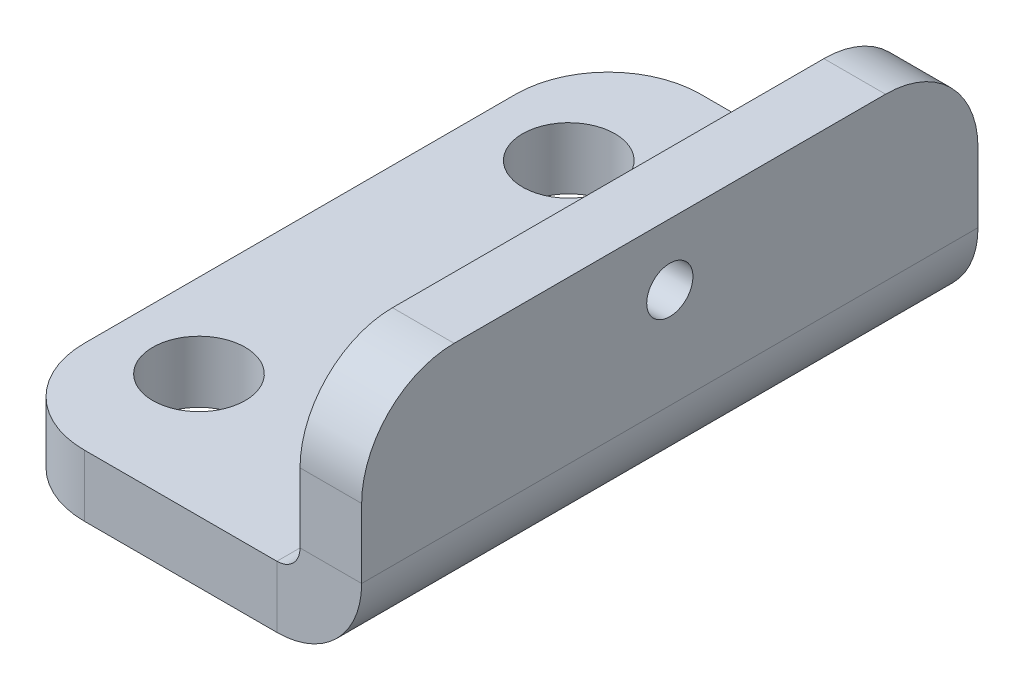
ISO-10303-21;
HEADER;
FILE_DESCRIPTION(('STEP AP214'),'2;1');
FILE_NAME('part.step','',(''),(''),'','','');
FILE_SCHEMA(('AUTOMOTIVE_DESIGN { 1 0 10303 214 1 1 1 1 }'));
ENDSEC;
DATA;
#1=APPLICATION_CONTEXT('core data for automotive mechanical design processes');
#2=APPLICATION_PROTOCOL_DEFINITION('international standard','automotive_design',2000,#1);
#3=PRODUCT_CONTEXT('',#1,'mechanical');
#4=PRODUCT('Part','Part','',(#3));
#5=PRODUCT_RELATED_PRODUCT_CATEGORY('part','',(#4));
#6=PRODUCT_DEFINITION_FORMATION('','',#4);
#7=PRODUCT_DEFINITION_CONTEXT('part definition',#1,'design');
#8=PRODUCT_DEFINITION('design','',#6,#7);
#9=PRODUCT_DEFINITION_SHAPE('','',#8);
#10=(LENGTH_UNIT() NAMED_UNIT(*) SI_UNIT(.MILLI.,.METRE.));
#11=(NAMED_UNIT(*) PLANE_ANGLE_UNIT() SI_UNIT($,.RADIAN.));
#12=(NAMED_UNIT(*) SI_UNIT($,.STERADIAN.) SOLID_ANGLE_UNIT());
#13=UNCERTAINTY_MEASURE_WITH_UNIT(LENGTH_MEASURE(1.E-05),#10,'distance_accuracy_value','');
#14=(GEOMETRIC_REPRESENTATION_CONTEXT(3) GLOBAL_UNCERTAINTY_ASSIGNED_CONTEXT((#13)) GLOBAL_UNIT_ASSIGNED_CONTEXT((#10,
#11,#12)) REPRESENTATION_CONTEXT('',''));
#15=CARTESIAN_POINT('',(0.,0.,0.));
#16=DIRECTION('',(0.,0.,1.));
#17=DIRECTION('',(1.,0.,0.));
#18=AXIS2_PLACEMENT_3D('',#15,#16,#17);
#19=CARTESIAN_POINT('',(-2.75,0.,10.));
#20=DIRECTION('',(0.,0.,1.));
#21=DIRECTION('',(1.,0.,0.));
#22=AXIS2_PLACEMENT_3D('',#19,#20,#21);
#23=PLANE('',#22);
#24=DIRECTION('',(0.,1.,0.));
#25=VECTOR('',#24,1.);
#26=CARTESIAN_POINT('',(-2.75,0.,10.));
#27=LINE('',#26,#25);
#28=CARTESIAN_POINT('',(-2.75,0.,10.));
#29=VERTEX_POINT('',#28);
#30=CARTESIAN_POINT('',(-2.75,2.,10.));
#31=VERTEX_POINT('',#30);
#32=EDGE_CURVE('E127',#29,#31,#27,.T.);
#33=ORIENTED_EDGE('',*,*,#32,.F.);
#34=CARTESIAN_POINT('',(-2.75,2.75,10.));
#35=DIRECTION('',(0.,0.,1.));
#36=DIRECTION('',(1.,0.,0.));
#37=AXIS2_PLACEMENT_3D('',#34,#35,#36);
#38=CIRCLE('',#37,2.75);
#39=CARTESIAN_POINT('',(0.,2.75,10.));
#40=VERTEX_POINT('',#39);
#41=EDGE_CURVE('E131',#40,#29,#38,.F.);
#42=ORIENTED_EDGE('',*,*,#41,.F.);
#43=DIRECTION('',(1.,0.,0.));
#44=VECTOR('',#43,1.);
#45=CARTESIAN_POINT('',(-2.,2.75,10.));
#46=LINE('',#45,#44);
#47=CARTESIAN_POINT('',(-2.,2.75,10.));
#48=VERTEX_POINT('',#47);
#49=EDGE_CURVE('E136',#48,#40,#46,.T.);
#50=ORIENTED_EDGE('',*,*,#49,.F.);
#51=CARTESIAN_POINT('',(-2.75,2.75,10.));
#52=DIRECTION('',(0.,0.,1.));
#53=DIRECTION('',(1.,0.,0.));
#54=AXIS2_PLACEMENT_3D('',#51,#52,#53);
#55=CIRCLE('',#54,0.75);
#56=EDGE_CURVE('E133',#48,#31,#55,.F.);
#57=ORIENTED_EDGE('',*,*,#56,.T.);
#58=EDGE_LOOP('',(#33,#42,#50,#57));
#59=FACE_BOUND('',#58,.T.);
#60=ADVANCED_FACE('F36',(#59),#23,.T.);
#61=CARTESIAN_POINT('',(-2.,2.75,10.));
#62=DIRECTION('',(0.,0.,1.));
#63=DIRECTION('',(1.,0.,0.));
#64=AXIS2_PLACEMENT_3D('',#61,#62,#63);
#65=PLANE('',#64);
#66=DIRECTION('',(-1.,0.,0.));
#67=VECTOR('',#66,1.);
#68=CARTESIAN_POINT('',(0.,2.,10.));
#69=LINE('',#68,#67);
#70=CARTESIAN_POINT('',(-9.,2.,10.));
#71=VERTEX_POINT('',#70);
#72=EDGE_CURVE('E154',#31,#71,#69,.T.);
#73=ORIENTED_EDGE('',*,*,#72,.T.);
#74=DIRECTION('',(0.,1.,0.));
#75=VECTOR('',#74,1.);
#76=CARTESIAN_POINT('',(-9.,2.75,10.));
#77=LINE('',#76,#75);
#78=CARTESIAN_POINT('',(-9.,0.,10.));
#79=VERTEX_POINT('',#78);
#80=EDGE_CURVE('E44',#71,#79,#77,.F.);
#81=ORIENTED_EDGE('',*,*,#80,.T.);
#82=DIRECTION('',(-1.,0.,0.));
#83=VECTOR('',#82,1.);
#84=CARTESIAN_POINT('',(0.,0.,10.));
#85=LINE('',#84,#83);
#86=EDGE_CURVE('E143',#29,#79,#85,.T.);
#87=ORIENTED_EDGE('',*,*,#86,.F.);
#88=ORIENTED_EDGE('',*,*,#32,.T.);
#89=EDGE_LOOP('',(#73,#81,#87,#88));
#90=FACE_BOUND('',#89,.T.);
#91=ADVANCED_FACE('F153',(#90),#65,.T.);
#92=CARTESIAN_POINT('',(0.,2.75,-10.));
#93=DIRECTION('',(0.,0.,-1.));
#94=DIRECTION('',(-1.,0.,0.));
#95=AXIS2_PLACEMENT_3D('',#92,#93,#94);
#96=PLANE('',#95);
#97=DIRECTION('',(-1.,0.,0.));
#98=VECTOR('',#97,1.);
#99=CARTESIAN_POINT('',(0.,2.75,-10.));
#100=LINE('',#99,#98);
#101=CARTESIAN_POINT('',(0.,2.75,-10.));
#102=VERTEX_POINT('',#101);
#103=CARTESIAN_POINT('',(-2.,2.75,-10.));
#104=VERTEX_POINT('',#103);
#105=EDGE_CURVE('E199',#102,#104,#100,.T.);
#106=ORIENTED_EDGE('',*,*,#105,.F.);
#107=CARTESIAN_POINT('',(-2.75,2.75,-10.));
#108=DIRECTION('',(0.,0.,1.));
#109=DIRECTION('',(1.,0.,0.));
#110=AXIS2_PLACEMENT_3D('',#107,#108,#109);
#111=CIRCLE('',#110,2.75);
#112=CARTESIAN_POINT('',(-2.75,0.,-10.));
#113=VERTEX_POINT('',#112);
#114=EDGE_CURVE('E173',#102,#113,#111,.F.);
#115=ORIENTED_EDGE('',*,*,#114,.T.);
#116=DIRECTION('',(0.,-1.,0.));
#117=VECTOR('',#116,1.);
#118=CARTESIAN_POINT('',(-2.75,2.,-10.));
#119=LINE('',#118,#117);
#120=CARTESIAN_POINT('',(-2.75,2.,-10.));
#121=VERTEX_POINT('',#120);
#122=EDGE_CURVE('E197',#121,#113,#119,.T.);
#123=ORIENTED_EDGE('',*,*,#122,.F.);
#124=CARTESIAN_POINT('',(-2.75,2.75,-10.));
#125=DIRECTION('',(0.,0.,1.));
#126=DIRECTION('',(1.,0.,0.));
#127=AXIS2_PLACEMENT_3D('',#124,#125,#126);
#128=CIRCLE('',#127,0.75);
#129=EDGE_CURVE('E179',#104,#121,#128,.F.);
#130=ORIENTED_EDGE('',*,*,#129,.F.);
#131=EDGE_LOOP('',(#106,#115,#123,#130));
#132=FACE_BOUND('',#131,.T.);
#133=ADVANCED_FACE('F301',(#132),#96,.T.);
#134=CARTESIAN_POINT('',(-2.75,2.,-10.));
#135=DIRECTION('',(0.,0.,-1.));
#136=DIRECTION('',(-1.,0.,0.));
#137=AXIS2_PLACEMENT_3D('',#134,#135,#136);
#138=PLANE('',#137);
#139=DIRECTION('',(0.,1.,0.));
#140=VECTOR('',#139,1.);
#141=CARTESIAN_POINT('',(-2.,8.,-10.));
#142=LINE('',#141,#140);
#143=CARTESIAN_POINT('',(-2.,5.,-10.));
#144=VERTEX_POINT('',#143);
#145=EDGE_CURVE('E177',#144,#104,#142,.F.);
#146=ORIENTED_EDGE('',*,*,#145,.F.);
#147=DIRECTION('',(1.,0.,0.));
#148=VECTOR('',#147,1.);
#149=CARTESIAN_POINT('',(-2.75,5.,-10.));
#150=LINE('',#149,#148);
#151=CARTESIAN_POINT('',(0.,5.,-10.));
#152=VERTEX_POINT('',#151);
#153=EDGE_CURVE('E135',#144,#152,#150,.T.);
#154=ORIENTED_EDGE('',*,*,#153,.T.);
#155=DIRECTION('',(0.,-1.,0.));
#156=VECTOR('',#155,1.);
#157=CARTESIAN_POINT('',(0.,8.,-10.));
#158=LINE('',#157,#156);
#159=EDGE_CURVE('E175',#152,#102,#158,.T.);
#160=ORIENTED_EDGE('',*,*,#159,.T.);
#161=ORIENTED_EDGE('',*,*,#105,.T.);
#162=EDGE_LOOP('',(#146,#154,#160,#161));
#163=FACE_BOUND('',#162,.T.);
#164=ADVANCED_FACE('F296',(#163),#138,.T.);
#165=CARTESIAN_POINT('',(0.,2.,10.));
#166=DIRECTION('',(0.,-1.,0.));
#167=DIRECTION('',(1.,0.,0.));
#168=AXIS2_PLACEMENT_3D('',#165,#166,#167);
#169=PLANE('',#168);
#170=CARTESIAN_POINT('',(-9.27896890843565,2.,6.));
#171=DIRECTION('',(0.,1.,0.));
#172=DIRECTION('',(1.,0.,0.));
#173=AXIS2_PLACEMENT_3D('',#170,#171,#172);
#174=CIRCLE('',#173,1.5);
#175=CARTESIAN_POINT('',(-7.77896890843565,2.,6.));
#176=VERTEX_POINT('',#175);
#177=EDGE_CURVE('E255',#176,#176,#174,.T.);
#178=ORIENTED_EDGE('',*,*,#177,.F.);
#179=EDGE_LOOP('',(#178));
#180=FACE_BOUND('',#179,.T.);
#181=CARTESIAN_POINT('',(-9.27896890843565,2.,-6.));
#182=DIRECTION('',(0.,1.,0.));
#183=DIRECTION('',(-1.,0.,0.));
#184=AXIS2_PLACEMENT_3D('',#181,#182,#183);
#185=CIRCLE('',#184,1.5);
#186=CARTESIAN_POINT('',(-10.7789689084356,2.,-6.));
#187=VERTEX_POINT('',#186);
#188=EDGE_CURVE('E249',#187,#187,#185,.T.);
#189=ORIENTED_EDGE('',*,*,#188,.F.);
#190=EDGE_LOOP('',(#189));
#191=FACE_BOUND('',#190,.T.);
#192=DIRECTION('',(-1.,0.,0.));
#193=VECTOR('',#192,1.);
#194=CARTESIAN_POINT('',(0.,2.,-10.));
#195=LINE('',#194,#193);
#196=CARTESIAN_POINT('',(-9.,2.,-10.));
#197=VERTEX_POINT('',#196);
#198=EDGE_CURVE('E168',#121,#197,#195,.T.);
#199=ORIENTED_EDGE('',*,*,#198,.T.);
#200=CARTESIAN_POINT('',(-9.,2.,-7.));
#201=DIRECTION('',(0.,-1.,0.));
#202=DIRECTION('',(1.,0.,0.));
#203=AXIS2_PLACEMENT_3D('',#200,#201,#202);
#204=CIRCLE('',#203,3.);
#205=CARTESIAN_POINT('',(-12.,2.,-7.));
#206=VERTEX_POINT('',#205);
#207=EDGE_CURVE('E224',#197,#206,#204,.F.);
#208=ORIENTED_EDGE('',*,*,#207,.T.);
#209=DIRECTION('',(0.,0.,-1.));
#210=VECTOR('',#209,1.);
#211=CARTESIAN_POINT('',(-12.,2.,10.));
#212=LINE('',#211,#210);
#213=CARTESIAN_POINT('',(-12.,2.,7.));
#214=VERTEX_POINT('',#213);
#215=EDGE_CURVE('E195',#214,#206,#212,.T.);
#216=ORIENTED_EDGE('',*,*,#215,.F.);
#217=CARTESIAN_POINT('',(-9.,2.,7.));
#218=DIRECTION('',(0.,-1.,0.));
#219=DIRECTION('',(1.,0.,0.));
#220=AXIS2_PLACEMENT_3D('',#217,#218,#219);
#221=CIRCLE('',#220,3.);
#222=EDGE_CURVE('E222',#214,#71,#221,.F.);
#223=ORIENTED_EDGE('',*,*,#222,.T.);
#224=ORIENTED_EDGE('',*,*,#72,.F.);
#225=DIRECTION('',(0.,0.,-1.));
#226=VECTOR('',#225,1.);
#227=CARTESIAN_POINT('',(-2.75,2.,10.));
#228=LINE('',#227,#226);
#229=EDGE_CURVE('E167',#31,#121,#228,.T.);
#230=ORIENTED_EDGE('',*,*,#229,.T.);
#231=EDGE_LOOP('',(#199,#208,#216,#223,#224,#230));
#232=FACE_BOUND('',#231,.T.);
#233=ADVANCED_FACE('F242',(#180,#191,#232),#169,.F.);
#234=CARTESIAN_POINT('',(-12.,0.,10.));
#235=DIRECTION('',(-1.,0.,0.));
#236=DIRECTION('',(0.,0.,1.));
#237=AXIS2_PLACEMENT_3D('',#234,#235,#236);
#238=PLANE('',#237);
#239=ORIENTED_EDGE('',*,*,#215,.T.);
#240=DIRECTION('',(0.,1.,0.));
#241=VECTOR('',#240,1.);
#242=CARTESIAN_POINT('',(-12.,0.,-7.));
#243=LINE('',#242,#241);
#244=CARTESIAN_POINT('',(-12.,0.,-7.));
#245=VERTEX_POINT('',#244);
#246=EDGE_CURVE('E58',#206,#245,#243,.F.);
#247=ORIENTED_EDGE('',*,*,#246,.T.);
#248=DIRECTION('',(0.,0.,-1.));
#249=VECTOR('',#248,1.);
#250=CARTESIAN_POINT('',(-12.,0.,10.));
#251=LINE('',#250,#249);
#252=CARTESIAN_POINT('',(-12.,0.,7.));
#253=VERTEX_POINT('',#252);
#254=EDGE_CURVE('E150',#253,#245,#251,.T.);
#255=ORIENTED_EDGE('',*,*,#254,.F.);
#256=DIRECTION('',(0.,1.,0.));
#257=VECTOR('',#256,1.);
#258=CARTESIAN_POINT('',(-12.,0.,7.));
#259=LINE('',#258,#257);
#260=EDGE_CURVE('E226',#253,#214,#259,.T.);
#261=ORIENTED_EDGE('',*,*,#260,.T.);
#262=EDGE_LOOP('',(#239,#247,#255,#261));
#263=FACE_BOUND('',#262,.T.);
#264=ADVANCED_FACE('F243',(#263),#238,.T.);
#265=CARTESIAN_POINT('',(0.,0.,10.));
#266=DIRECTION('',(0.,-1.,0.));
#267=DIRECTION('',(1.,0.,0.));
#268=AXIS2_PLACEMENT_3D('',#265,#266,#267);
#269=PLANE('',#268);
#270=CARTESIAN_POINT('',(-9.27896890843565,0.,6.));
#271=DIRECTION('',(0.,1.,0.));
#272=DIRECTION('',(1.,0.,0.));
#273=AXIS2_PLACEMENT_3D('',#270,#271,#272);
#274=CIRCLE('',#273,1.5);
#275=CARTESIAN_POINT('',(-7.77896890843565,0.,6.));
#276=VERTEX_POINT('',#275);
#277=EDGE_CURVE('E252',#276,#276,#274,.T.);
#278=ORIENTED_EDGE('',*,*,#277,.T.);
#279=EDGE_LOOP('',(#278));
#280=FACE_BOUND('',#279,.T.);
#281=CARTESIAN_POINT('',(-9.27896890843565,0.,-6.));
#282=DIRECTION('',(0.,1.,0.));
#283=DIRECTION('',(-1.,0.,0.));
#284=AXIS2_PLACEMENT_3D('',#281,#282,#283);
#285=CIRCLE('',#284,1.5);
#286=CARTESIAN_POINT('',(-10.7789689084356,0.,-6.));
#287=VERTEX_POINT('',#286);
#288=EDGE_CURVE('E171',#287,#287,#285,.T.);
#289=ORIENTED_EDGE('',*,*,#288,.T.);
#290=EDGE_LOOP('',(#289));
#291=FACE_BOUND('',#290,.T.);
#292=ORIENTED_EDGE('',*,*,#254,.T.);
#293=CARTESIAN_POINT('',(-9.,0.,-7.));
#294=DIRECTION('',(0.,-1.,0.));
#295=DIRECTION('',(1.,0.,0.));
#296=AXIS2_PLACEMENT_3D('',#293,#294,#295);
#297=CIRCLE('',#296,3.);
#298=CARTESIAN_POINT('',(-9.,0.,-10.));
#299=VERTEX_POINT('',#298);
#300=EDGE_CURVE('E232',#245,#299,#297,.T.);
#301=ORIENTED_EDGE('',*,*,#300,.T.);
#302=DIRECTION('',(-1.,0.,0.));
#303=VECTOR('',#302,1.);
#304=CARTESIAN_POINT('',(0.,0.,-10.));
#305=LINE('',#304,#303);
#306=EDGE_CURVE('E146',#113,#299,#305,.T.);
#307=ORIENTED_EDGE('',*,*,#306,.F.);
#308=DIRECTION('',(0.,0.,-1.));
#309=VECTOR('',#308,1.);
#310=CARTESIAN_POINT('',(-2.75,0.,10.));
#311=LINE('',#310,#309);
#312=EDGE_CURVE('E141',#29,#113,#311,.T.);
#313=ORIENTED_EDGE('',*,*,#312,.F.);
#314=ORIENTED_EDGE('',*,*,#86,.T.);
#315=CARTESIAN_POINT('',(-9.,0.,7.));
#316=DIRECTION('',(0.,-1.,0.));
#317=DIRECTION('',(1.,0.,0.));
#318=AXIS2_PLACEMENT_3D('',#315,#316,#317);
#319=CIRCLE('',#318,3.);
#320=EDGE_CURVE('E230',#79,#253,#319,.T.);
#321=ORIENTED_EDGE('',*,*,#320,.T.);
#322=EDGE_LOOP('',(#292,#301,#307,#313,#314,#321));
#323=FACE_BOUND('',#322,.T.);
#324=ADVANCED_FACE('F142',(#280,#291,#323),#269,.T.);
#325=CARTESIAN_POINT('',(-2.75,2.75,10.));
#326=DIRECTION('',(0.,0.,-1.));
#327=DIRECTION('',(-1.,0.,0.));
#328=AXIS2_PLACEMENT_3D('',#325,#326,#327);
#329=CYLINDRICAL_SURFACE('',#328,2.75);
#330=ORIENTED_EDGE('',*,*,#114,.F.);
#331=DIRECTION('',(0.,0.,-1.));
#332=VECTOR('',#331,1.);
#333=CARTESIAN_POINT('',(0.,2.75,10.));
#334=LINE('',#333,#332);
#335=EDGE_CURVE('E151',#40,#102,#334,.T.);
#336=ORIENTED_EDGE('',*,*,#335,.F.);
#337=ORIENTED_EDGE('',*,*,#41,.T.);
#338=ORIENTED_EDGE('',*,*,#312,.T.);
#339=EDGE_LOOP('',(#330,#336,#337,#338));
#340=FACE_BOUND('',#339,.T.);
#341=ADVANCED_FACE('F157',(#340),#329,.T.);
#342=CARTESIAN_POINT('',(0.,8.,10.));
#343=DIRECTION('',(1.,0.,0.));
#344=DIRECTION('',(0.,0.,-1.));
#345=AXIS2_PLACEMENT_3D('',#342,#343,#344);
#346=PLANE('',#345);
#347=CARTESIAN_POINT('',(0.,6.,0.));
#348=DIRECTION('',(-1.,0.,0.));
#349=DIRECTION('',(0.,0.,1.));
#350=AXIS2_PLACEMENT_3D('',#347,#348,#349);
#351=CIRCLE('',#350,0.75);
#352=CARTESIAN_POINT('',(0.,6.,0.75));
#353=VERTEX_POINT('',#352);
#354=EDGE_CURVE('E258',#353,#353,#351,.T.);
#355=ORIENTED_EDGE('',*,*,#354,.T.);
#356=EDGE_LOOP('',(#355));
#357=FACE_BOUND('',#356,.T.);
#358=ORIENTED_EDGE('',*,*,#159,.F.);
#359=CARTESIAN_POINT('',(0.,5.,-7.));
#360=DIRECTION('',(1.,0.,0.));
#361=DIRECTION('',(0.,0.,-1.));
#362=AXIS2_PLACEMENT_3D('',#359,#360,#361);
#363=CIRCLE('',#362,3.);
#364=CARTESIAN_POINT('',(0.,8.,-7.));
#365=VERTEX_POINT('',#364);
#366=EDGE_CURVE('E208',#152,#365,#363,.T.);
#367=ORIENTED_EDGE('',*,*,#366,.T.);
#368=DIRECTION('',(0.,0.,-1.));
#369=VECTOR('',#368,1.);
#370=CARTESIAN_POINT('',(0.,8.,10.));
#371=LINE('',#370,#369);
#372=CARTESIAN_POINT('',(0.,8.,7.));
#373=VERTEX_POINT('',#372);
#374=EDGE_CURVE('E190',#373,#365,#371,.T.);
#375=ORIENTED_EDGE('',*,*,#374,.F.);
#376=CARTESIAN_POINT('',(0.,5.,7.));
#377=DIRECTION('',(1.,0.,0.));
#378=DIRECTION('',(0.,0.,-1.));
#379=AXIS2_PLACEMENT_3D('',#376,#377,#378);
#380=CIRCLE('',#379,3.);
#381=CARTESIAN_POINT('',(0.,5.,10.));
#382=VERTEX_POINT('',#381);
#383=EDGE_CURVE('E206',#373,#382,#380,.T.);
#384=ORIENTED_EDGE('',*,*,#383,.T.);
#385=DIRECTION('',(0.,-1.,0.));
#386=VECTOR('',#385,1.);
#387=CARTESIAN_POINT('',(0.,8.,10.));
#388=LINE('',#387,#386);
#389=EDGE_CURVE('E159',#382,#40,#388,.T.);
#390=ORIENTED_EDGE('',*,*,#389,.T.);
#391=ORIENTED_EDGE('',*,*,#335,.T.);
#392=EDGE_LOOP('',(#358,#367,#375,#384,#390,#391));
#393=FACE_BOUND('',#392,.T.);
#394=ADVANCED_FACE('F267',(#357,#393),#346,.T.);
#395=CARTESIAN_POINT('',(-2.,8.,10.));
#396=DIRECTION('',(0.,1.,0.));
#397=DIRECTION('',(0.,0.,1.));
#398=AXIS2_PLACEMENT_3D('',#395,#396,#397);
#399=PLANE('',#398);
#400=ORIENTED_EDGE('',*,*,#374,.T.);
#401=DIRECTION('',(1.,0.,0.));
#402=VECTOR('',#401,1.);
#403=CARTESIAN_POINT('',(-2.,8.,-7.));
#404=LINE('',#403,#402);
#405=CARTESIAN_POINT('',(-2.,8.,-7.));
#406=VERTEX_POINT('',#405);
#407=EDGE_CURVE('E213',#365,#406,#404,.F.);
#408=ORIENTED_EDGE('',*,*,#407,.T.);
#409=DIRECTION('',(0.,0.,-1.));
#410=VECTOR('',#409,1.);
#411=CARTESIAN_POINT('',(-2.,8.,10.));
#412=LINE('',#411,#410);
#413=CARTESIAN_POINT('',(-2.,8.,7.));
#414=VERTEX_POINT('',#413);
#415=EDGE_CURVE('E187',#414,#406,#412,.T.);
#416=ORIENTED_EDGE('',*,*,#415,.F.);
#417=DIRECTION('',(1.,0.,0.));
#418=VECTOR('',#417,1.);
#419=CARTESIAN_POINT('',(-2.,8.,7.));
#420=LINE('',#419,#418);
#421=EDGE_CURVE('E210',#414,#373,#420,.T.);
#422=ORIENTED_EDGE('',*,*,#421,.T.);
#423=EDGE_LOOP('',(#400,#408,#416,#422));
#424=FACE_BOUND('',#423,.T.);
#425=ADVANCED_FACE('F281',(#424),#399,.T.);
#426=CARTESIAN_POINT('',(-2.,8.,10.));
#427=DIRECTION('',(1.,0.,0.));
#428=DIRECTION('',(0.,0.,-1.));
#429=AXIS2_PLACEMENT_3D('',#426,#427,#428);
#430=PLANE('',#429);
#431=CARTESIAN_POINT('',(-2.,6.,0.));
#432=DIRECTION('',(-1.,0.,0.));
#433=DIRECTION('',(0.,0.,1.));
#434=AXIS2_PLACEMENT_3D('',#431,#432,#433);
#435=CIRCLE('',#434,0.75);
#436=CARTESIAN_POINT('',(-2.,6.,0.75));
#437=VERTEX_POINT('',#436);
#438=EDGE_CURVE('E261',#437,#437,#435,.T.);
#439=ORIENTED_EDGE('',*,*,#438,.F.);
#440=EDGE_LOOP('',(#439));
#441=FACE_BOUND('',#440,.T.);
#442=ORIENTED_EDGE('',*,*,#415,.T.);
#443=CARTESIAN_POINT('',(-2.,5.,-7.));
#444=DIRECTION('',(1.,0.,0.));
#445=DIRECTION('',(0.,0.,-1.));
#446=AXIS2_PLACEMENT_3D('',#443,#444,#445);
#447=CIRCLE('',#446,3.);
#448=EDGE_CURVE('E217',#406,#144,#447,.F.);
#449=ORIENTED_EDGE('',*,*,#448,.T.);
#450=ORIENTED_EDGE('',*,*,#145,.T.);
#451=DIRECTION('',(0.,0.,-1.));
#452=VECTOR('',#451,1.);
#453=CARTESIAN_POINT('',(-2.,2.75,10.));
#454=LINE('',#453,#452);
#455=EDGE_CURVE('E184',#48,#104,#454,.T.);
#456=ORIENTED_EDGE('',*,*,#455,.F.);
#457=DIRECTION('',(0.,1.,0.));
#458=VECTOR('',#457,1.);
#459=CARTESIAN_POINT('',(-2.,8.,10.));
#460=LINE('',#459,#458);
#461=CARTESIAN_POINT('',(-2.,5.,10.));
#462=VERTEX_POINT('',#461);
#463=EDGE_CURVE('E161',#462,#48,#460,.F.);
#464=ORIENTED_EDGE('',*,*,#463,.F.);
#465=CARTESIAN_POINT('',(-2.,5.,7.));
#466=DIRECTION('',(1.,0.,0.));
#467=DIRECTION('',(0.,0.,-1.));
#468=AXIS2_PLACEMENT_3D('',#465,#466,#467);
#469=CIRCLE('',#468,3.);
#470=EDGE_CURVE('E215',#462,#414,#469,.F.);
#471=ORIENTED_EDGE('',*,*,#470,.T.);
#472=EDGE_LOOP('',(#442,#449,#450,#456,#464,#471));
#473=FACE_BOUND('',#472,.T.);
#474=ADVANCED_FACE('F277',(#441,#473),#430,.F.);
#475=CARTESIAN_POINT('',(-2.75,2.75,10.));
#476=DIRECTION('',(0.,0.,-1.));
#477=DIRECTION('',(-1.,0.,0.));
#478=AXIS2_PLACEMENT_3D('',#475,#476,#477);
#479=CYLINDRICAL_SURFACE('',#478,0.75);
#480=ORIENTED_EDGE('',*,*,#129,.T.);
#481=ORIENTED_EDGE('',*,*,#229,.F.);
#482=ORIENTED_EDGE('',*,*,#56,.F.);
#483=ORIENTED_EDGE('',*,*,#455,.T.);
#484=EDGE_LOOP('',(#480,#481,#482,#483));
#485=FACE_BOUND('',#484,.T.);
#486=ADVANCED_FACE('F280',(#485),#479,.F.);
#487=CARTESIAN_POINT('',(-2.75,2.75,10.));
#488=DIRECTION('',(0.,0.,1.));
#489=DIRECTION('',(1.,0.,0.));
#490=AXIS2_PLACEMENT_3D('',#487,#488,#489);
#491=PLANE('',#490);
#492=ORIENTED_EDGE('',*,*,#389,.F.);
#493=DIRECTION('',(1.,0.,0.));
#494=VECTOR('',#493,1.);
#495=CARTESIAN_POINT('',(-2.75,5.,10.));
#496=LINE('',#495,#494);
#497=EDGE_CURVE('E11',#382,#462,#496,.F.);
#498=ORIENTED_EDGE('',*,*,#497,.T.);
#499=ORIENTED_EDGE('',*,*,#463,.T.);
#500=ORIENTED_EDGE('',*,*,#49,.T.);
#501=EDGE_LOOP('',(#492,#498,#499,#500));
#502=FACE_BOUND('',#501,.T.);
#503=ADVANCED_FACE('F308',(#502),#491,.T.);
#504=CARTESIAN_POINT('',(-2.75,2.75,-10.));
#505=DIRECTION('',(0.,0.,1.));
#506=DIRECTION('',(1.,0.,0.));
#507=AXIS2_PLACEMENT_3D('',#504,#505,#506);
#508=PLANE('',#507);
#509=ORIENTED_EDGE('',*,*,#306,.T.);
#510=DIRECTION('',(0.,1.,0.));
#511=VECTOR('',#510,1.);
#512=CARTESIAN_POINT('',(-9.,2.,-10.));
#513=LINE('',#512,#511);
#514=EDGE_CURVE('E219',#299,#197,#513,.T.);
#515=ORIENTED_EDGE('',*,*,#514,.T.);
#516=ORIENTED_EDGE('',*,*,#198,.F.);
#517=ORIENTED_EDGE('',*,*,#122,.T.);
#518=EDGE_LOOP('',(#509,#515,#516,#517));
#519=FACE_BOUND('',#518,.T.);
#520=ADVANCED_FACE('F237',(#519),#508,.F.);
#521=CARTESIAN_POINT('',(-2.75,5.,-7.));
#522=DIRECTION('',(1.,0.,0.));
#523=DIRECTION('',(0.,0.,-1.));
#524=AXIS2_PLACEMENT_3D('',#521,#522,#523);
#525=CYLINDRICAL_SURFACE('',#524,3.);
#526=ORIENTED_EDGE('',*,*,#448,.F.);
#527=ORIENTED_EDGE('',*,*,#407,.F.);
#528=ORIENTED_EDGE('',*,*,#366,.F.);
#529=ORIENTED_EDGE('',*,*,#153,.F.);
#530=EDGE_LOOP('',(#526,#527,#528,#529));
#531=FACE_BOUND('',#530,.T.);
#532=ADVANCED_FACE('F293',(#531),#525,.T.);
#533=CARTESIAN_POINT('',(-9.,2.75,-7.));
#534=DIRECTION('',(0.,-1.,0.));
#535=DIRECTION('',(0.,0.,-1.));
#536=AXIS2_PLACEMENT_3D('',#533,#534,#535);
#537=CYLINDRICAL_SURFACE('',#536,3.);
#538=ORIENTED_EDGE('',*,*,#300,.F.);
#539=ORIENTED_EDGE('',*,*,#246,.F.);
#540=ORIENTED_EDGE('',*,*,#207,.F.);
#541=ORIENTED_EDGE('',*,*,#514,.F.);
#542=EDGE_LOOP('',(#538,#539,#540,#541));
#543=FACE_BOUND('',#542,.T.);
#544=ADVANCED_FACE('F239',(#543),#537,.T.);
#545=CARTESIAN_POINT('',(-9.,0.,7.));
#546=DIRECTION('',(0.,1.,0.));
#547=DIRECTION('',(0.,0.,1.));
#548=AXIS2_PLACEMENT_3D('',#545,#546,#547);
#549=CYLINDRICAL_SURFACE('',#548,3.);
#550=ORIENTED_EDGE('',*,*,#320,.F.);
#551=ORIENTED_EDGE('',*,*,#80,.F.);
#552=ORIENTED_EDGE('',*,*,#222,.F.);
#553=ORIENTED_EDGE('',*,*,#260,.F.);
#554=EDGE_LOOP('',(#550,#551,#552,#553));
#555=FACE_BOUND('',#554,.T.);
#556=ADVANCED_FACE('F246',(#555),#549,.T.);
#557=CARTESIAN_POINT('',(-2.,5.,7.));
#558=DIRECTION('',(1.,0.,0.));
#559=DIRECTION('',(0.,0.,-1.));
#560=AXIS2_PLACEMENT_3D('',#557,#558,#559);
#561=CYLINDRICAL_SURFACE('',#560,3.);
#562=ORIENTED_EDGE('',*,*,#470,.F.);
#563=ORIENTED_EDGE('',*,*,#497,.F.);
#564=ORIENTED_EDGE('',*,*,#383,.F.);
#565=ORIENTED_EDGE('',*,*,#421,.F.);
#566=EDGE_LOOP('',(#562,#563,#564,#565));
#567=FACE_BOUND('',#566,.T.);
#568=ADVANCED_FACE('F38',(#567),#561,.T.);
#569=CARTESIAN_POINT('',(-9.27896890843565,0.,-6.));
#570=DIRECTION('',(0.,1.,0.));
#571=DIRECTION('',(-1.,0.,0.));
#572=AXIS2_PLACEMENT_3D('',#569,#570,#571);
#573=CYLINDRICAL_SURFACE('',#572,1.5);
#574=ORIENTED_EDGE('',*,*,#288,.F.);
#575=EDGE_LOOP('',(#574));
#576=FACE_BOUND('',#575,.T.);
#577=ORIENTED_EDGE('',*,*,#188,.T.);
#578=EDGE_LOOP('',(#577));
#579=FACE_BOUND('',#578,.T.);
#580=ADVANCED_FACE('F333',(#576,#579),#573,.F.);
#581=CARTESIAN_POINT('',(-9.27896890843565,0.,6.));
#582=DIRECTION('',(0.,1.,0.));
#583=DIRECTION('',(-1.,0.,0.));
#584=AXIS2_PLACEMENT_3D('',#581,#582,#583);
#585=CYLINDRICAL_SURFACE('',#584,1.5);
#586=ORIENTED_EDGE('',*,*,#277,.F.);
#587=EDGE_LOOP('',(#586));
#588=FACE_BOUND('',#587,.T.);
#589=ORIENTED_EDGE('',*,*,#177,.T.);
#590=EDGE_LOOP('',(#589));
#591=FACE_BOUND('',#590,.T.);
#592=ADVANCED_FACE('F273',(#588,#591),#585,.F.);
#593=CARTESIAN_POINT('',(0.,6.,0.));
#594=DIRECTION('',(-1.,0.,0.));
#595=DIRECTION('',(0.,0.,1.));
#596=AXIS2_PLACEMENT_3D('',#593,#594,#595);
#597=CYLINDRICAL_SURFACE('',#596,0.75);
#598=ORIENTED_EDGE('',*,*,#354,.F.);
#599=EDGE_LOOP('',(#598));
#600=FACE_BOUND('',#599,.T.);
#601=ORIENTED_EDGE('',*,*,#438,.T.);
#602=EDGE_LOOP('',(#601));
#603=FACE_BOUND('',#602,.T.);
#604=ADVANCED_FACE('F270',(#600,#603),#597,.F.);
#605=CLOSED_SHELL('',(#60,#91,#133,#164,#233,#264,#324,#341,#394,#425,#474,#486,#503,#520,#532,
#544,#556,#568,#580,#592,#604));
#606=MANIFOLD_SOLID_BREP('B2',#605);
#607=ADVANCED_BREP_SHAPE_REPRESENTATION('',(#18,#606),#14);
#608=SHAPE_DEFINITION_REPRESENTATION(#9,#607);
ENDSEC;
END-ISO-10303-21;
